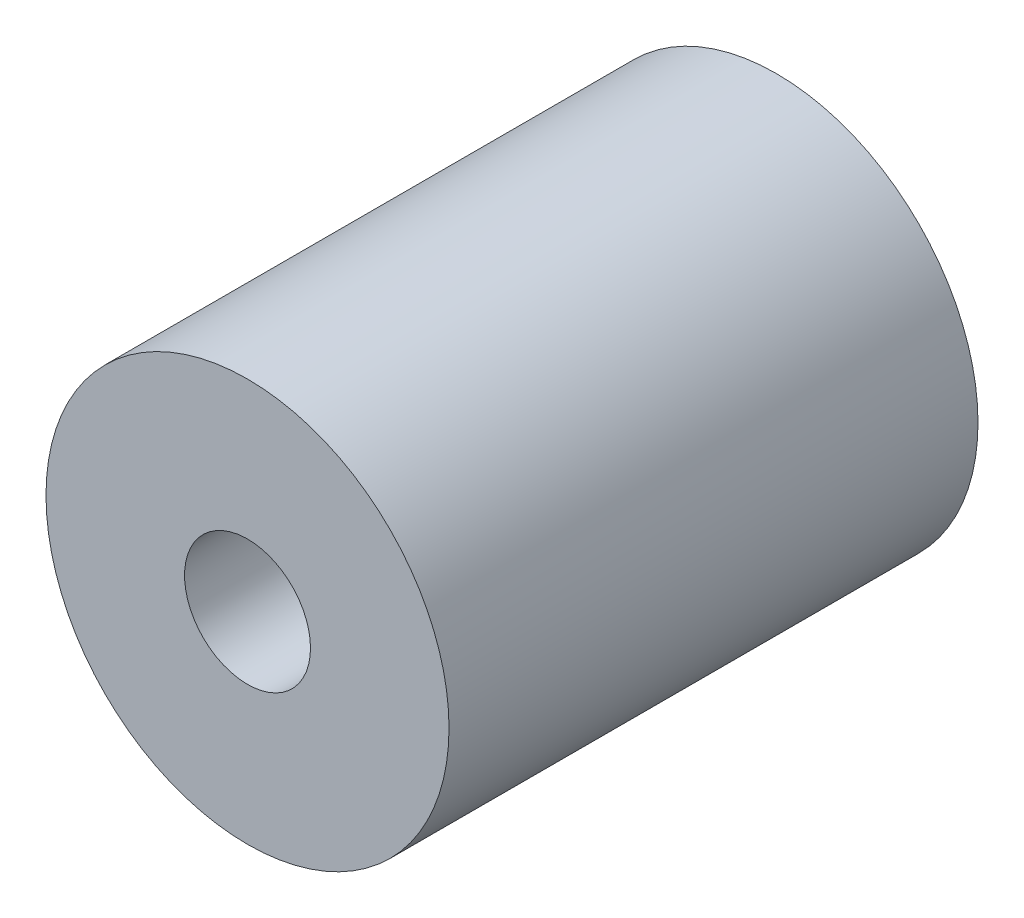
ISO-10303-21;
HEADER;
FILE_DESCRIPTION(('STEP AP214'),'2;1');
FILE_NAME('part.step','',(''),(''),'','','');
FILE_SCHEMA(('AUTOMOTIVE_DESIGN { 1 0 10303 214 1 1 1 1 }'));
ENDSEC;
DATA;
#1=APPLICATION_CONTEXT('core data for automotive mechanical design processes');
#2=APPLICATION_PROTOCOL_DEFINITION('international standard','automotive_design',2000,#1);
#3=PRODUCT_CONTEXT('',#1,'mechanical');
#4=PRODUCT('Part','Part','',(#3));
#5=PRODUCT_RELATED_PRODUCT_CATEGORY('part','',(#4));
#6=PRODUCT_DEFINITION_FORMATION('','',#4);
#7=PRODUCT_DEFINITION_CONTEXT('part definition',#1,'design');
#8=PRODUCT_DEFINITION('design','',#6,#7);
#9=PRODUCT_DEFINITION_SHAPE('','',#8);
#10=(LENGTH_UNIT() NAMED_UNIT(*) SI_UNIT(.MILLI.,.METRE.));
#11=(NAMED_UNIT(*) PLANE_ANGLE_UNIT() SI_UNIT($,.RADIAN.));
#12=(NAMED_UNIT(*) SI_UNIT($,.STERADIAN.) SOLID_ANGLE_UNIT());
#13=UNCERTAINTY_MEASURE_WITH_UNIT(LENGTH_MEASURE(1.E-05),#10,'distance_accuracy_value','');
#14=(GEOMETRIC_REPRESENTATION_CONTEXT(3) GLOBAL_UNCERTAINTY_ASSIGNED_CONTEXT((#13)) GLOBAL_UNIT_ASSIGNED_CONTEXT((#10,
#11,#12)) REPRESENTATION_CONTEXT('',''));
#15=CARTESIAN_POINT('',(0.,0.,0.));
#16=DIRECTION('',(0.,0.,1.));
#17=DIRECTION('',(1.,0.,0.));
#18=AXIS2_PLACEMENT_3D('',#15,#16,#17);
#19=CARTESIAN_POINT('',(0.,0.,42.));
#20=DIRECTION('',(0.,0.,1.));
#21=DIRECTION('',(1.,0.,0.));
#22=AXIS2_PLACEMENT_3D('',#19,#20,#21);
#23=PLANE('',#22);
#24=CARTESIAN_POINT('',(0.,0.,42.));
#25=DIRECTION('',(0.,0.,1.));
#26=DIRECTION('',(1.,0.,0.));
#27=AXIS2_PLACEMENT_3D('',#24,#25,#26);
#28=CIRCLE('',#27,16.);
#29=CARTESIAN_POINT('',(16.,0.,42.));
#30=VERTEX_POINT('',#29);
#31=EDGE_CURVE('E10',#30,#30,#28,.T.);
#32=ORIENTED_EDGE('',*,*,#31,.T.);
#33=EDGE_LOOP('',(#32));
#34=FACE_BOUND('',#33,.T.);
#35=CARTESIAN_POINT('',(0.,0.,42.));
#36=DIRECTION('',(0.,0.,1.));
#37=DIRECTION('',(1.,0.,0.));
#38=AXIS2_PLACEMENT_3D('',#35,#36,#37);
#39=CIRCLE('',#38,5.);
#40=CARTESIAN_POINT('',(5.,0.,42.));
#41=VERTEX_POINT('',#40);
#42=EDGE_CURVE('E50',#41,#41,#39,.T.);
#43=ORIENTED_EDGE('',*,*,#42,.F.);
#44=EDGE_LOOP('',(#43));
#45=FACE_BOUND('',#44,.T.);
#46=ADVANCED_FACE('F37',(#34,#45),#23,.T.);
#47=CARTESIAN_POINT('',(0.,0.,0.));
#48=DIRECTION('',(0.,0.,1.));
#49=DIRECTION('',(1.,0.,0.));
#50=AXIS2_PLACEMENT_3D('',#47,#48,#49);
#51=PLANE('',#50);
#52=CARTESIAN_POINT('',(0.,0.,0.));
#53=DIRECTION('',(0.,0.,1.));
#54=DIRECTION('',(1.,0.,0.));
#55=AXIS2_PLACEMENT_3D('',#52,#53,#54);
#56=CIRCLE('',#55,16.);
#57=CARTESIAN_POINT('',(16.,0.,0.));
#58=VERTEX_POINT('',#57);
#59=EDGE_CURVE('E41',#58,#58,#56,.T.);
#60=ORIENTED_EDGE('',*,*,#59,.F.);
#61=EDGE_LOOP('',(#60));
#62=FACE_BOUND('',#61,.T.);
#63=CARTESIAN_POINT('',(0.,0.,0.));
#64=DIRECTION('',(0.,0.,1.));
#65=DIRECTION('',(1.,0.,0.));
#66=AXIS2_PLACEMENT_3D('',#63,#64,#65);
#67=CIRCLE('',#66,5.);
#68=CARTESIAN_POINT('',(5.,0.,0.));
#69=VERTEX_POINT('',#68);
#70=EDGE_CURVE('E52',#69,#69,#67,.T.);
#71=ORIENTED_EDGE('',*,*,#70,.T.);
#72=EDGE_LOOP('',(#71));
#73=FACE_BOUND('',#72,.T.);
#74=ADVANCED_FACE('F64',(#62,#73),#51,.F.);
#75=CARTESIAN_POINT('',(0.,0.,42.));
#76=DIRECTION('',(0.,0.,-1.));
#77=DIRECTION('',(-1.,0.,0.));
#78=AXIS2_PLACEMENT_3D('',#75,#76,#77);
#79=CYLINDRICAL_SURFACE('',#78,16.);
#80=ORIENTED_EDGE('',*,*,#31,.F.);
#81=EDGE_LOOP('',(#80));
#82=FACE_BOUND('',#81,.T.);
#83=ORIENTED_EDGE('',*,*,#59,.T.);
#84=EDGE_LOOP('',(#83));
#85=FACE_BOUND('',#84,.T.);
#86=ADVANCED_FACE('F39',(#82,#85),#79,.T.);
#87=CARTESIAN_POINT('',(0.,0.,42.));
#88=DIRECTION('',(0.,0.,-1.));
#89=DIRECTION('',(-1.,0.,0.));
#90=AXIS2_PLACEMENT_3D('',#87,#88,#89);
#91=CYLINDRICAL_SURFACE('',#90,5.);
#92=ORIENTED_EDGE('',*,*,#42,.T.);
#93=EDGE_LOOP('',(#92));
#94=FACE_BOUND('',#93,.T.);
#95=ORIENTED_EDGE('',*,*,#70,.F.);
#96=EDGE_LOOP('',(#95));
#97=FACE_BOUND('',#96,.T.);
#98=ADVANCED_FACE('F60',(#94,#97),#91,.F.);
#99=CLOSED_SHELL('',(#46,#74,#86,#98));
#100=MANIFOLD_SOLID_BREP('B2',#99);
#101=ADVANCED_BREP_SHAPE_REPRESENTATION('',(#18,#100),#14);
#102=SHAPE_DEFINITION_REPRESENTATION(#9,#101);
ENDSEC;
END-ISO-10303-21;
